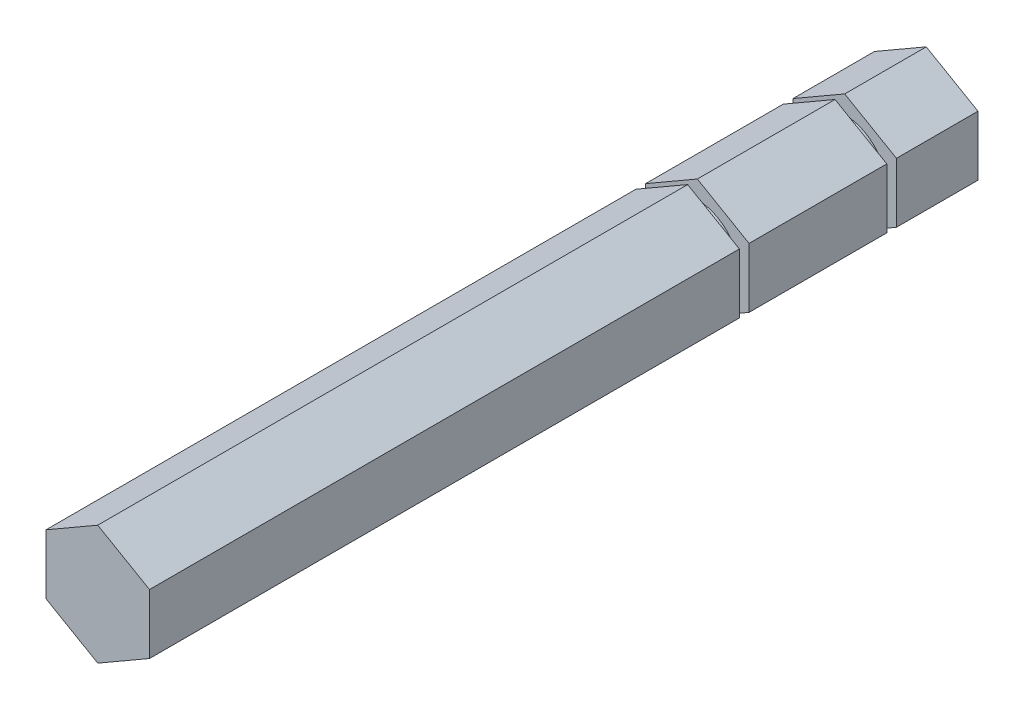
ISO-10303-21;
HEADER;
FILE_DESCRIPTION(('STEP AP214'),'2;1');
FILE_NAME('part.step','',(''),(''),'','','');
FILE_SCHEMA(('AUTOMOTIVE_DESIGN { 1 0 10303 214 1 1 1 1 }'));
ENDSEC;
DATA;
#1=APPLICATION_CONTEXT('core data for automotive mechanical design processes');
#2=APPLICATION_PROTOCOL_DEFINITION('international standard','automotive_design',2000,#1);
#3=PRODUCT_CONTEXT('',#1,'mechanical');
#4=PRODUCT('Part','Part','',(#3));
#5=PRODUCT_RELATED_PRODUCT_CATEGORY('part','',(#4));
#6=PRODUCT_DEFINITION_FORMATION('','',#4);
#7=PRODUCT_DEFINITION_CONTEXT('part definition',#1,'design');
#8=PRODUCT_DEFINITION('design','',#6,#7);
#9=PRODUCT_DEFINITION_SHAPE('','',#8);
#10=(LENGTH_UNIT() NAMED_UNIT(*) SI_UNIT(.MILLI.,.METRE.));
#11=(NAMED_UNIT(*) PLANE_ANGLE_UNIT() SI_UNIT($,.RADIAN.));
#12=(NAMED_UNIT(*) SI_UNIT($,.STERADIAN.) SOLID_ANGLE_UNIT());
#13=UNCERTAINTY_MEASURE_WITH_UNIT(LENGTH_MEASURE(1.E-05),#10,'distance_accuracy_value','');
#14=(GEOMETRIC_REPRESENTATION_CONTEXT(3) GLOBAL_UNCERTAINTY_ASSIGNED_CONTEXT((#13)) GLOBAL_UNIT_ASSIGNED_CONTEXT((#10,
#11,#12)) REPRESENTATION_CONTEXT('',''));
#15=CARTESIAN_POINT('',(0.,0.,0.));
#16=DIRECTION('',(0.,0.,1.));
#17=DIRECTION('',(1.,0.,0.));
#18=AXIS2_PLACEMENT_3D('',#15,#16,#17);
#19=CARTESIAN_POINT('',(4.76249999999996,2.74963065701564,76.2508));
#20=DIRECTION('',(-0.499999999999995,-0.866025403784442,0.));
#21=DIRECTION('',(0.866025403784441,-0.499999999999995,0.));
#22=AXIS2_PLACEMENT_3D('',#19,#20,#21);
#23=PLANE('',#22);
#24=DIRECTION('',(0.,0.,-1.));
#25=VECTOR('',#24,1.);
#26=CARTESIAN_POINT('',(4.76249999999996,2.74963065701564,76.2508));
#27=LINE('',#26,#25);
#28=CARTESIAN_POINT('',(4.76249999999996,2.74963065701564,76.2508));
#29=VERTEX_POINT('',#28);
#30=CARTESIAN_POINT('',(4.76249999999996,2.74963065701564,21.9583));
#31=VERTEX_POINT('',#30);
#32=EDGE_CURVE('E200',#29,#31,#27,.T.);
#33=ORIENTED_EDGE('',*,*,#32,.T.);
#34=DIRECTION('',(-0.866025403784441,0.499999999999995,0.));
#35=VECTOR('',#34,1.);
#36=CARTESIAN_POINT('',(4.76249999999996,2.74963065701564,21.9583));
#37=LINE('',#36,#35);
#38=CARTESIAN_POINT('',(0.,5.49926131403118,21.9583));
#39=VERTEX_POINT('',#38);
#40=EDGE_CURVE('E208',#31,#39,#37,.T.);
#41=ORIENTED_EDGE('',*,*,#40,.T.);
#42=DIRECTION('',(0.,0.,-1.));
#43=VECTOR('',#42,1.);
#44=CARTESIAN_POINT('',(0.,5.49926131403118,76.2508));
#45=LINE('',#44,#43);
#46=CARTESIAN_POINT('',(0.,5.49926131403118,76.2508));
#47=VERTEX_POINT('',#46);
#48=EDGE_CURVE('E178',#47,#39,#45,.T.);
#49=ORIENTED_EDGE('',*,*,#48,.F.);
#50=DIRECTION('',(-0.866025403784441,0.499999999999995,0.));
#51=VECTOR('',#50,1.);
#52=CARTESIAN_POINT('',(4.76249999999996,2.74963065701564,76.2508));
#53=LINE('',#52,#51);
#54=EDGE_CURVE('E210',#29,#47,#53,.T.);
#55=ORIENTED_EDGE('',*,*,#54,.F.);
#56=EDGE_LOOP('',(#33,#41,#49,#55));
#57=FACE_BOUND('',#56,.T.);
#58=ADVANCED_FACE('F33',(#57),#23,.F.);
#59=CARTESIAN_POINT('',(0.,5.49926131403118,76.2508));
#60=DIRECTION('',(0.500000000000001,-0.866025403784438,0.));
#61=DIRECTION('',(0.866025403784438,0.500000000000001,0.));
#62=AXIS2_PLACEMENT_3D('',#59,#60,#61);
#63=PLANE('',#62);
#64=ORIENTED_EDGE('',*,*,#48,.T.);
#65=DIRECTION('',(-0.866025403784438,-0.500000000000001,0.));
#66=VECTOR('',#65,1.);
#67=CARTESIAN_POINT('',(0.,5.49926131403118,21.9583));
#68=LINE('',#67,#66);
#69=CARTESIAN_POINT('',(-4.7625,2.74963065701558,21.9583));
#70=VERTEX_POINT('',#69);
#71=EDGE_CURVE('E330',#39,#70,#68,.T.);
#72=ORIENTED_EDGE('',*,*,#71,.T.);
#73=DIRECTION('',(0.,0.,-1.));
#74=VECTOR('',#73,1.);
#75=CARTESIAN_POINT('',(-4.7625,2.74963065701558,76.2508));
#76=LINE('',#75,#74);
#77=CARTESIAN_POINT('',(-4.7625,2.74963065701558,76.2508));
#78=VERTEX_POINT('',#77);
#79=EDGE_CURVE('E176',#78,#70,#76,.T.);
#80=ORIENTED_EDGE('',*,*,#79,.F.);
#81=DIRECTION('',(-0.866025403784438,-0.500000000000001,0.));
#82=VECTOR('',#81,1.);
#83=CARTESIAN_POINT('',(0.,5.49926131403118,76.2508));
#84=LINE('',#83,#82);
#85=EDGE_CURVE('E242',#47,#78,#84,.T.);
#86=ORIENTED_EDGE('',*,*,#85,.F.);
#87=EDGE_LOOP('',(#64,#72,#80,#86));
#88=FACE_BOUND('',#87,.T.);
#89=ADVANCED_FACE('F332',(#88),#63,.F.);
#90=CARTESIAN_POINT('',(-4.7625,2.74963065701558,76.2508));
#91=DIRECTION('',(1.,0.,0.));
#92=DIRECTION('',(0.,1.,0.));
#93=AXIS2_PLACEMENT_3D('',#90,#91,#92);
#94=PLANE('',#93);
#95=ORIENTED_EDGE('',*,*,#79,.T.);
#96=DIRECTION('',(0.,-1.,0.));
#97=VECTOR('',#96,1.);
#98=CARTESIAN_POINT('',(-4.7625,2.74963065701558,21.9583));
#99=LINE('',#98,#97);
#100=CARTESIAN_POINT('',(-4.76249999999998,-2.74963065701561,21.9583));
#101=VERTEX_POINT('',#100);
#102=EDGE_CURVE('E328',#70,#101,#99,.T.);
#103=ORIENTED_EDGE('',*,*,#102,.T.);
#104=DIRECTION('',(0.,0.,-1.));
#105=VECTOR('',#104,1.);
#106=CARTESIAN_POINT('',(-4.76249999999998,-2.74963065701561,76.2508));
#107=LINE('',#106,#105);
#108=CARTESIAN_POINT('',(-4.76249999999998,-2.74963065701561,76.2508));
#109=VERTEX_POINT('',#108);
#110=EDGE_CURVE('E271',#109,#101,#107,.T.);
#111=ORIENTED_EDGE('',*,*,#110,.F.);
#112=DIRECTION('',(0.,-1.,0.));
#113=VECTOR('',#112,1.);
#114=CARTESIAN_POINT('',(-4.7625,2.74963065701558,76.2508));
#115=LINE('',#114,#113);
#116=EDGE_CURVE('E244',#78,#109,#115,.T.);
#117=ORIENTED_EDGE('',*,*,#116,.F.);
#118=EDGE_LOOP('',(#95,#103,#111,#117));
#119=FACE_BOUND('',#118,.T.);
#120=ADVANCED_FACE('F334',(#119),#94,.F.);
#121=CARTESIAN_POINT('',(-4.76249999999998,-2.74963065701561,76.2508));
#122=DIRECTION('',(0.499999999999995,0.866025403784441,0.));
#123=DIRECTION('',(-0.866025403784442,0.499999999999995,0.));
#124=AXIS2_PLACEMENT_3D('',#121,#122,#123);
#125=PLANE('',#124);
#126=ORIENTED_EDGE('',*,*,#110,.T.);
#127=DIRECTION('',(0.866025403784442,-0.499999999999995,0.));
#128=VECTOR('',#127,1.);
#129=CARTESIAN_POINT('',(-4.76249999999998,-2.74963065701561,21.9583));
#130=LINE('',#129,#128);
#131=CARTESIAN_POINT('',(0.,-5.49926131403118,21.9583));
#132=VERTEX_POINT('',#131);
#133=EDGE_CURVE('E261',#101,#132,#130,.T.);
#134=ORIENTED_EDGE('',*,*,#133,.T.);
#135=DIRECTION('',(0.,0.,-1.));
#136=VECTOR('',#135,1.);
#137=CARTESIAN_POINT('',(0.,-5.49926131403118,76.2508));
#138=LINE('',#137,#136);
#139=CARTESIAN_POINT('',(0.,-5.49926131403118,76.2508));
#140=VERTEX_POINT('',#139);
#141=EDGE_CURVE('E259',#140,#132,#138,.T.);
#142=ORIENTED_EDGE('',*,*,#141,.F.);
#143=DIRECTION('',(0.866025403784442,-0.499999999999995,0.));
#144=VECTOR('',#143,1.);
#145=CARTESIAN_POINT('',(-4.76249999999998,-2.74963065701561,76.2508));
#146=LINE('',#145,#144);
#147=EDGE_CURVE('E224',#109,#140,#146,.T.);
#148=ORIENTED_EDGE('',*,*,#147,.F.);
#149=EDGE_LOOP('',(#126,#134,#142,#148));
#150=FACE_BOUND('',#149,.T.);
#151=ADVANCED_FACE('F260',(#150),#125,.F.);
#152=CARTESIAN_POINT('',(0.,-5.49926131403118,76.2508));
#153=DIRECTION('',(-0.500000000000007,0.866025403784434,0.));
#154=DIRECTION('',(-0.866025403784435,-0.500000000000007,0.));
#155=AXIS2_PLACEMENT_3D('',#152,#153,#154);
#156=PLANE('',#155);
#157=ORIENTED_EDGE('',*,*,#141,.T.);
#158=DIRECTION('',(0.866025403784435,0.500000000000007,0.));
#159=VECTOR('',#158,1.);
#160=CARTESIAN_POINT('',(0.,-5.49926131403118,21.9583));
#161=LINE('',#160,#159);
#162=CARTESIAN_POINT('',(4.76250000000002,-2.74963065701554,21.9583));
#163=VERTEX_POINT('',#162);
#164=EDGE_CURVE('E268',#132,#163,#161,.T.);
#165=ORIENTED_EDGE('',*,*,#164,.T.);
#166=DIRECTION('',(0.,0.,-1.));
#167=VECTOR('',#166,1.);
#168=CARTESIAN_POINT('',(4.76250000000002,-2.74963065701554,76.2508));
#169=LINE('',#168,#167);
#170=CARTESIAN_POINT('',(4.76250000000002,-2.74963065701554,76.2508));
#171=VERTEX_POINT('',#170);
#172=EDGE_CURVE('E203',#171,#163,#169,.T.);
#173=ORIENTED_EDGE('',*,*,#172,.F.);
#174=DIRECTION('',(0.866025403784435,0.500000000000007,0.));
#175=VECTOR('',#174,1.);
#176=CARTESIAN_POINT('',(0.,-5.49926131403118,76.2508));
#177=LINE('',#176,#175);
#178=EDGE_CURVE('E221',#140,#171,#177,.T.);
#179=ORIENTED_EDGE('',*,*,#178,.F.);
#180=EDGE_LOOP('',(#157,#165,#173,#179));
#181=FACE_BOUND('',#180,.T.);
#182=ADVANCED_FACE('F267',(#181),#156,.F.);
#183=CARTESIAN_POINT('',(4.76250000000002,-2.74963065701554,76.2508));
#184=DIRECTION('',(-1.,0.,0.));
#185=DIRECTION('',(0.,-1.,0.));
#186=AXIS2_PLACEMENT_3D('',#183,#184,#185);
#187=PLANE('',#186);
#188=ORIENTED_EDGE('',*,*,#172,.T.);
#189=DIRECTION('',(0.,1.,0.));
#190=VECTOR('',#189,1.);
#191=CARTESIAN_POINT('',(4.76250000000002,-2.74963065701554,21.9583));
#192=LINE('',#191,#190);
#193=EDGE_CURVE('E160',#163,#31,#192,.T.);
#194=ORIENTED_EDGE('',*,*,#193,.T.);
#195=ORIENTED_EDGE('',*,*,#32,.F.);
#196=DIRECTION('',(0.,1.,0.));
#197=VECTOR('',#196,1.);
#198=CARTESIAN_POINT('',(4.76250000000002,-2.74963065701554,76.2508));
#199=LINE('',#198,#197);
#200=EDGE_CURVE('E219',#171,#29,#199,.T.);
#201=ORIENTED_EDGE('',*,*,#200,.F.);
#202=EDGE_LOOP('',(#188,#194,#195,#201));
#203=FACE_BOUND('',#202,.T.);
#204=ADVANCED_FACE('F198',(#203),#187,.F.);
#205=CARTESIAN_POINT('',(0.,0.,76.2508));
#206=DIRECTION('',(0.,0.,1.));
#207=DIRECTION('',(1.,0.,0.));
#208=AXIS2_PLACEMENT_3D('',#205,#206,#207);
#209=PLANE('',#208);
#210=ORIENTED_EDGE('',*,*,#54,.T.);
#211=ORIENTED_EDGE('',*,*,#85,.T.);
#212=ORIENTED_EDGE('',*,*,#116,.T.);
#213=ORIENTED_EDGE('',*,*,#147,.T.);
#214=ORIENTED_EDGE('',*,*,#178,.T.);
#215=ORIENTED_EDGE('',*,*,#200,.T.);
#216=EDGE_LOOP('',(#210,#211,#212,#213,#214,#215));
#217=FACE_BOUND('',#216,.T.);
#218=ADVANCED_FACE('F251',(#217),#209,.T.);
#219=CARTESIAN_POINT('',(0.,0.,21.9583));
#220=DIRECTION('',(0.,0.,1.));
#221=DIRECTION('',(1.,0.,0.));
#222=AXIS2_PLACEMENT_3D('',#219,#220,#221);
#223=PLANE('',#222);
#224=CARTESIAN_POINT('',(0.,0.,21.9583));
#225=DIRECTION('',(0.,0.,-1.));
#226=DIRECTION('',(-1.,0.,0.));
#227=AXIS2_PLACEMENT_3D('',#224,#225,#226);
#228=CIRCLE('',#227,3.8481);
#229=CARTESIAN_POINT('',(-3.8481,0.,21.9583));
#230=VERTEX_POINT('',#229);
#231=EDGE_CURVE('E311',#230,#230,#228,.T.);
#232=ORIENTED_EDGE('',*,*,#231,.F.);
#233=EDGE_LOOP('',(#232));
#234=FACE_BOUND('',#233,.T.);
#235=ORIENTED_EDGE('',*,*,#193,.F.);
#236=ORIENTED_EDGE('',*,*,#164,.F.);
#237=ORIENTED_EDGE('',*,*,#133,.F.);
#238=ORIENTED_EDGE('',*,*,#102,.F.);
#239=ORIENTED_EDGE('',*,*,#71,.F.);
#240=ORIENTED_EDGE('',*,*,#40,.F.);
#241=EDGE_LOOP('',(#235,#236,#237,#238,#239,#240));
#242=FACE_BOUND('',#241,.T.);
#243=ADVANCED_FACE('F335',(#234,#242),#223,.F.);
#244=CARTESIAN_POINT('',(0.,0.,21.0693));
#245=DIRECTION('',(0.,0.,1.));
#246=DIRECTION('',(1.,0.,0.));
#247=AXIS2_PLACEMENT_3D('',#244,#245,#246);
#248=PLANE('',#247);
#249=CARTESIAN_POINT('',(0.,0.,21.0693));
#250=DIRECTION('',(0.,0.,-1.));
#251=DIRECTION('',(-1.,0.,0.));
#252=AXIS2_PLACEMENT_3D('',#249,#250,#251);
#253=CIRCLE('',#252,3.8481);
#254=CARTESIAN_POINT('',(-3.8481,0.,21.0693));
#255=VERTEX_POINT('',#254);
#256=EDGE_CURVE('E310',#255,#255,#253,.T.);
#257=ORIENTED_EDGE('',*,*,#256,.T.);
#258=EDGE_LOOP('',(#257));
#259=FACE_BOUND('',#258,.T.);
#260=DIRECTION('',(-0.866025403784441,0.499999999999995,0.));
#261=VECTOR('',#260,1.);
#262=CARTESIAN_POINT('',(4.76249999999996,2.74963065701564,21.0693));
#263=LINE('',#262,#261);
#264=CARTESIAN_POINT('',(4.76249999999996,2.74963065701564,21.0693));
#265=VERTEX_POINT('',#264);
#266=CARTESIAN_POINT('',(0.,5.49926131403118,21.0693));
#267=VERTEX_POINT('',#266);
#268=EDGE_CURVE('E324',#265,#267,#263,.T.);
#269=ORIENTED_EDGE('',*,*,#268,.T.);
#270=DIRECTION('',(-0.866025403784438,-0.500000000000001,0.));
#271=VECTOR('',#270,1.);
#272=CARTESIAN_POINT('',(0.,5.49926131403118,21.0693));
#273=LINE('',#272,#271);
#274=CARTESIAN_POINT('',(-4.7625,2.74963065701558,21.0693));
#275=VERTEX_POINT('',#274);
#276=EDGE_CURVE('E322',#267,#275,#273,.T.);
#277=ORIENTED_EDGE('',*,*,#276,.T.);
#278=DIRECTION('',(0.,-1.,0.));
#279=VECTOR('',#278,1.);
#280=CARTESIAN_POINT('',(-4.7625,2.74963065701558,21.0693));
#281=LINE('',#280,#279);
#282=CARTESIAN_POINT('',(-4.76249999999998,-2.74963065701561,21.0693));
#283=VERTEX_POINT('',#282);
#284=EDGE_CURVE('E320',#275,#283,#281,.T.);
#285=ORIENTED_EDGE('',*,*,#284,.T.);
#286=DIRECTION('',(0.866025403784442,-0.499999999999995,0.));
#287=VECTOR('',#286,1.);
#288=CARTESIAN_POINT('',(-4.76249999999998,-2.74963065701561,21.0693));
#289=LINE('',#288,#287);
#290=CARTESIAN_POINT('',(0.,-5.49926131403118,21.0693));
#291=VERTEX_POINT('',#290);
#292=EDGE_CURVE('E318',#283,#291,#289,.T.);
#293=ORIENTED_EDGE('',*,*,#292,.T.);
#294=DIRECTION('',(0.866025403784435,0.500000000000007,0.));
#295=VECTOR('',#294,1.);
#296=CARTESIAN_POINT('',(0.,-5.49926131403118,21.0693));
#297=LINE('',#296,#295);
#298=CARTESIAN_POINT('',(4.76250000000002,-2.74963065701554,21.0693));
#299=VERTEX_POINT('',#298);
#300=EDGE_CURVE('E314',#291,#299,#297,.T.);
#301=ORIENTED_EDGE('',*,*,#300,.T.);
#302=DIRECTION('',(0.,1.,0.));
#303=VECTOR('',#302,1.);
#304=CARTESIAN_POINT('',(4.76250000000002,-2.74963065701554,21.0693));
#305=LINE('',#304,#303);
#306=EDGE_CURVE('E185',#299,#265,#305,.T.);
#307=ORIENTED_EDGE('',*,*,#306,.T.);
#308=EDGE_LOOP('',(#269,#277,#285,#293,#301,#307));
#309=FACE_BOUND('',#308,.T.);
#310=ADVANCED_FACE('F337',(#259,#309),#248,.T.);
#311=CARTESIAN_POINT('',(0.,0.,21.9583));
#312=DIRECTION('',(0.,0.,-1.));
#313=DIRECTION('',(-1.,0.,0.));
#314=AXIS2_PLACEMENT_3D('',#311,#312,#313);
#315=CYLINDRICAL_SURFACE('',#314,3.8481);
#316=ORIENTED_EDGE('',*,*,#231,.T.);
#317=EDGE_LOOP('',(#316));
#318=FACE_BOUND('',#317,.T.);
#319=ORIENTED_EDGE('',*,*,#256,.F.);
#320=EDGE_LOOP('',(#319));
#321=FACE_BOUND('',#320,.T.);
#322=ADVANCED_FACE('F344',(#318,#321),#315,.T.);
#323=CARTESIAN_POINT('',(4.76250000000002,-2.74963065701554,8.39470000000001));
#324=VERTEX_POINT('',#323);
#325=EDGE_CURVE('E215',#299,#324,#169,.T.);
#326=ORIENTED_EDGE('',*,*,#325,.T.);
#327=DIRECTION('',(0.,1.,0.));
#328=VECTOR('',#327,1.);
#329=CARTESIAN_POINT('',(4.76250000000002,-2.74963065701554,8.39470000000001));
#330=LINE('',#329,#328);
#331=CARTESIAN_POINT('',(4.76249999999996,2.74963065701564,8.39470000000001));
#332=VERTEX_POINT('',#331);
#333=EDGE_CURVE('E307',#324,#332,#330,.T.);
#334=ORIENTED_EDGE('',*,*,#333,.T.);
#335=EDGE_CURVE('E212',#265,#332,#27,.T.);
#336=ORIENTED_EDGE('',*,*,#335,.F.);
#337=ORIENTED_EDGE('',*,*,#306,.F.);
#338=EDGE_LOOP('',(#326,#334,#336,#337));
#339=FACE_BOUND('',#338,.T.);
#340=ADVANCED_FACE('F371',(#339),#187,.F.);
#341=CARTESIAN_POINT('',(0.,-5.49926131403118,8.39470000000001));
#342=VERTEX_POINT('',#341);
#343=EDGE_CURVE('E264',#291,#342,#138,.T.);
#344=ORIENTED_EDGE('',*,*,#343,.T.);
#345=DIRECTION('',(0.866025403784435,0.500000000000007,0.));
#346=VECTOR('',#345,1.);
#347=CARTESIAN_POINT('',(0.,-5.49926131403118,8.39470000000001));
#348=LINE('',#347,#346);
#349=EDGE_CURVE('E304',#342,#324,#348,.T.);
#350=ORIENTED_EDGE('',*,*,#349,.T.);
#351=ORIENTED_EDGE('',*,*,#325,.F.);
#352=ORIENTED_EDGE('',*,*,#300,.F.);
#353=EDGE_LOOP('',(#344,#350,#351,#352));
#354=FACE_BOUND('',#353,.T.);
#355=ADVANCED_FACE('F375',(#354),#156,.F.);
#356=CARTESIAN_POINT('',(-4.76249999999998,-2.74963065701561,8.39470000000001));
#357=VERTEX_POINT('',#356);
#358=EDGE_CURVE('E272',#283,#357,#107,.T.);
#359=ORIENTED_EDGE('',*,*,#358,.T.);
#360=DIRECTION('',(0.866025403784442,-0.499999999999995,0.));
#361=VECTOR('',#360,1.);
#362=CARTESIAN_POINT('',(-4.76249999999998,-2.74963065701561,8.39470000000001));
#363=LINE('',#362,#361);
#364=EDGE_CURVE('E301',#357,#342,#363,.T.);
#365=ORIENTED_EDGE('',*,*,#364,.T.);
#366=ORIENTED_EDGE('',*,*,#343,.F.);
#367=ORIENTED_EDGE('',*,*,#292,.F.);
#368=EDGE_LOOP('',(#359,#365,#366,#367));
#369=FACE_BOUND('',#368,.T.);
#370=ADVANCED_FACE('F380',(#369),#125,.F.);
#371=CARTESIAN_POINT('',(-4.7625,2.74963065701558,8.39470000000001));
#372=VERTEX_POINT('',#371);
#373=EDGE_CURVE('E181',#275,#372,#76,.T.);
#374=ORIENTED_EDGE('',*,*,#373,.T.);
#375=DIRECTION('',(0.,-1.,0.));
#376=VECTOR('',#375,1.);
#377=CARTESIAN_POINT('',(-4.7625,2.74963065701558,8.39470000000001));
#378=LINE('',#377,#376);
#379=EDGE_CURVE('E298',#372,#357,#378,.T.);
#380=ORIENTED_EDGE('',*,*,#379,.T.);
#381=ORIENTED_EDGE('',*,*,#358,.F.);
#382=ORIENTED_EDGE('',*,*,#284,.F.);
#383=EDGE_LOOP('',(#374,#380,#381,#382));
#384=FACE_BOUND('',#383,.T.);
#385=ADVANCED_FACE('F366',(#384),#94,.F.);
#386=CARTESIAN_POINT('',(0.,5.49926131403118,8.39470000000001));
#387=VERTEX_POINT('',#386);
#388=EDGE_CURVE('E175',#267,#387,#45,.T.);
#389=ORIENTED_EDGE('',*,*,#388,.T.);
#390=DIRECTION('',(-0.866025403784438,-0.500000000000001,0.));
#391=VECTOR('',#390,1.);
#392=CARTESIAN_POINT('',(0.,5.49926131403118,8.39470000000001));
#393=LINE('',#392,#391);
#394=EDGE_CURVE('E47',#387,#372,#393,.T.);
#395=ORIENTED_EDGE('',*,*,#394,.T.);
#396=ORIENTED_EDGE('',*,*,#373,.F.);
#397=ORIENTED_EDGE('',*,*,#276,.F.);
#398=EDGE_LOOP('',(#389,#395,#396,#397));
#399=FACE_BOUND('',#398,.T.);
#400=ADVANCED_FACE('F355',(#399),#63,.F.);
#401=ORIENTED_EDGE('',*,*,#335,.T.);
#402=DIRECTION('',(-0.866025403784441,0.499999999999995,0.));
#403=VECTOR('',#402,1.);
#404=CARTESIAN_POINT('',(4.76249999999996,2.74963065701564,8.39470000000001));
#405=LINE('',#404,#403);
#406=EDGE_CURVE('E11',#332,#387,#405,.T.);
#407=ORIENTED_EDGE('',*,*,#406,.T.);
#408=ORIENTED_EDGE('',*,*,#388,.F.);
#409=ORIENTED_EDGE('',*,*,#268,.F.);
#410=EDGE_LOOP('',(#401,#407,#408,#409));
#411=FACE_BOUND('',#410,.T.);
#412=ADVANCED_FACE('F351',(#411),#23,.F.);
#413=CARTESIAN_POINT('',(0.,0.,8.3947));
#414=DIRECTION('',(0.,0.,1.));
#415=DIRECTION('',(1.,0.,0.));
#416=AXIS2_PLACEMENT_3D('',#413,#414,#415);
#417=PLANE('',#416);
#418=CARTESIAN_POINT('',(0.,0.,8.3947));
#419=DIRECTION('',(0.,0.,-1.));
#420=DIRECTION('',(-1.,0.,0.));
#421=AXIS2_PLACEMENT_3D('',#418,#419,#420);
#422=CIRCLE('',#421,3.8481);
#423=CARTESIAN_POINT('',(-3.8481,0.,8.3947));
#424=VERTEX_POINT('',#423);
#425=EDGE_CURVE('E169',#424,#424,#422,.T.);
#426=ORIENTED_EDGE('',*,*,#425,.F.);
#427=EDGE_LOOP('',(#426));
#428=FACE_BOUND('',#427,.T.);
#429=ORIENTED_EDGE('',*,*,#349,.F.);
#430=ORIENTED_EDGE('',*,*,#364,.F.);
#431=ORIENTED_EDGE('',*,*,#379,.F.);
#432=ORIENTED_EDGE('',*,*,#394,.F.);
#433=ORIENTED_EDGE('',*,*,#406,.F.);
#434=ORIENTED_EDGE('',*,*,#333,.F.);
#435=EDGE_LOOP('',(#429,#430,#431,#432,#433,#434));
#436=FACE_BOUND('',#435,.T.);
#437=ADVANCED_FACE('F358',(#428,#436),#417,.F.);
#438=CARTESIAN_POINT('',(0.,0.,7.5057));
#439=DIRECTION('',(0.,0.,1.));
#440=DIRECTION('',(1.,0.,0.));
#441=AXIS2_PLACEMENT_3D('',#438,#439,#440);
#442=PLANE('',#441);
#443=CARTESIAN_POINT('',(0.,0.,7.5057));
#444=DIRECTION('',(0.,0.,-1.));
#445=DIRECTION('',(-1.,0.,0.));
#446=AXIS2_PLACEMENT_3D('',#443,#444,#445);
#447=CIRCLE('',#446,3.8481);
#448=CARTESIAN_POINT('',(-3.8481,0.,7.5057));
#449=VERTEX_POINT('',#448);
#450=EDGE_CURVE('E570',#449,#449,#447,.T.);
#451=ORIENTED_EDGE('',*,*,#450,.T.);
#452=EDGE_LOOP('',(#451));
#453=FACE_BOUND('',#452,.T.);
#454=DIRECTION('',(0.,1.,0.));
#455=VECTOR('',#454,1.);
#456=CARTESIAN_POINT('',(4.76250000000002,-2.74963065701554,7.5057));
#457=LINE('',#456,#455);
#458=CARTESIAN_POINT('',(4.76250000000002,-2.74963065701554,7.5057));
#459=VERTEX_POINT('',#458);
#460=CARTESIAN_POINT('',(4.76249999999996,2.74963065701564,7.5057));
#461=VERTEX_POINT('',#460);
#462=EDGE_CURVE('E54',#459,#461,#457,.T.);
#463=ORIENTED_EDGE('',*,*,#462,.T.);
#464=DIRECTION('',(-0.866025403784441,0.499999999999995,0.));
#465=VECTOR('',#464,1.);
#466=CARTESIAN_POINT('',(4.76249999999996,2.74963065701564,7.5057));
#467=LINE('',#466,#465);
#468=CARTESIAN_POINT('',(0.,5.49926131403118,7.5057));
#469=VERTEX_POINT('',#468);
#470=EDGE_CURVE('E40',#461,#469,#467,.T.);
#471=ORIENTED_EDGE('',*,*,#470,.T.);
#472=DIRECTION('',(-0.866025403784438,-0.500000000000001,0.));
#473=VECTOR('',#472,1.);
#474=CARTESIAN_POINT('',(0.,5.49926131403118,7.5057));
#475=LINE('',#474,#473);
#476=CARTESIAN_POINT('',(-4.7625,2.74963065701558,7.5057));
#477=VERTEX_POINT('',#476);
#478=EDGE_CURVE('E155',#469,#477,#475,.T.);
#479=ORIENTED_EDGE('',*,*,#478,.T.);
#480=DIRECTION('',(0.,-1.,0.));
#481=VECTOR('',#480,1.);
#482=CARTESIAN_POINT('',(-4.7625,2.74963065701558,7.5057));
#483=LINE('',#482,#481);
#484=CARTESIAN_POINT('',(-4.76249999999998,-2.74963065701561,7.5057));
#485=VERTEX_POINT('',#484);
#486=EDGE_CURVE('E168',#477,#485,#483,.T.);
#487=ORIENTED_EDGE('',*,*,#486,.T.);
#488=DIRECTION('',(0.866025403784442,-0.499999999999995,0.));
#489=VECTOR('',#488,1.);
#490=CARTESIAN_POINT('',(-4.76249999999998,-2.74963065701561,7.5057));
#491=LINE('',#490,#489);
#492=CARTESIAN_POINT('',(0.,-5.49926131403118,7.5057));
#493=VERTEX_POINT('',#492);
#494=EDGE_CURVE('E281',#485,#493,#491,.T.);
#495=ORIENTED_EDGE('',*,*,#494,.T.);
#496=DIRECTION('',(0.866025403784435,0.500000000000007,0.));
#497=VECTOR('',#496,1.);
#498=CARTESIAN_POINT('',(0.,-5.49926131403118,7.5057));
#499=LINE('',#498,#497);
#500=EDGE_CURVE('E291',#493,#459,#499,.T.);
#501=ORIENTED_EDGE('',*,*,#500,.T.);
#502=EDGE_LOOP('',(#463,#471,#479,#487,#495,#501));
#503=FACE_BOUND('',#502,.T.);
#504=ADVANCED_FACE('F154',(#453,#503),#442,.T.);
#505=CARTESIAN_POINT('',(0.,0.,8.3947));
#506=DIRECTION('',(0.,0.,-1.));
#507=DIRECTION('',(-1.,0.,0.));
#508=AXIS2_PLACEMENT_3D('',#505,#506,#507);
#509=CYLINDRICAL_SURFACE('',#508,3.8481);
#510=ORIENTED_EDGE('',*,*,#425,.T.);
#511=EDGE_LOOP('',(#510));
#512=FACE_BOUND('',#511,.T.);
#513=ORIENTED_EDGE('',*,*,#450,.F.);
#514=EDGE_LOOP('',(#513));
#515=FACE_BOUND('',#514,.T.);
#516=ADVANCED_FACE('F412',(#512,#515),#509,.T.);
#517=CARTESIAN_POINT('',(0.,0.,0.));
#518=DIRECTION('',(0.,0.,1.));
#519=DIRECTION('',(1.,0.,0.));
#520=AXIS2_PLACEMENT_3D('',#517,#518,#519);
#521=PLANE('',#520);
#522=DIRECTION('',(-0.866025403784441,0.499999999999995,0.));
#523=VECTOR('',#522,1.);
#524=CARTESIAN_POINT('',(4.76249999999996,2.74963065701564,0.));
#525=LINE('',#524,#523);
#526=CARTESIAN_POINT('',(4.76249999999996,2.74963065701564,0.));
#527=VERTEX_POINT('',#526);
#528=CARTESIAN_POINT('',(0.,5.49926131403118,0.));
#529=VERTEX_POINT('',#528);
#530=EDGE_CURVE('E174',#527,#529,#525,.T.);
#531=ORIENTED_EDGE('',*,*,#530,.F.);
#532=DIRECTION('',(0.,1.,0.));
#533=VECTOR('',#532,1.);
#534=CARTESIAN_POINT('',(4.76250000000002,-2.74963065701554,0.));
#535=LINE('',#534,#533);
#536=CARTESIAN_POINT('',(4.76250000000002,-2.74963065701554,0.));
#537=VERTEX_POINT('',#536);
#538=EDGE_CURVE('E239',#537,#527,#535,.T.);
#539=ORIENTED_EDGE('',*,*,#538,.F.);
#540=DIRECTION('',(0.866025403784435,0.500000000000007,0.));
#541=VECTOR('',#540,1.);
#542=CARTESIAN_POINT('',(0.,-5.49926131403118,0.));
#543=LINE('',#542,#541);
#544=CARTESIAN_POINT('',(0.,-5.49926131403118,0.));
#545=VERTEX_POINT('',#544);
#546=EDGE_CURVE('E237',#545,#537,#543,.T.);
#547=ORIENTED_EDGE('',*,*,#546,.F.);
#548=DIRECTION('',(0.866025403784442,-0.499999999999995,0.));
#549=VECTOR('',#548,1.);
#550=CARTESIAN_POINT('',(-4.76249999999998,-2.74963065701561,0.));
#551=LINE('',#550,#549);
#552=CARTESIAN_POINT('',(-4.76249999999998,-2.74963065701561,0.));
#553=VERTEX_POINT('',#552);
#554=EDGE_CURVE('E234',#553,#545,#551,.T.);
#555=ORIENTED_EDGE('',*,*,#554,.F.);
#556=DIRECTION('',(0.,-1.,0.));
#557=VECTOR('',#556,1.);
#558=CARTESIAN_POINT('',(-4.7625,2.74963065701558,0.));
#559=LINE('',#558,#557);
#560=CARTESIAN_POINT('',(-4.7625,2.74963065701558,0.));
#561=VERTEX_POINT('',#560);
#562=EDGE_CURVE('E231',#561,#553,#559,.T.);
#563=ORIENTED_EDGE('',*,*,#562,.F.);
#564=DIRECTION('',(-0.866025403784438,-0.500000000000001,0.));
#565=VECTOR('',#564,1.);
#566=CARTESIAN_POINT('',(0.,5.49926131403118,0.));
#567=LINE('',#566,#565);
#568=EDGE_CURVE('E229',#529,#561,#567,.T.);
#569=ORIENTED_EDGE('',*,*,#568,.F.);
#570=EDGE_LOOP('',(#531,#539,#547,#555,#563,#569));
#571=FACE_BOUND('',#570,.T.);
#572=ADVANCED_FACE('F286',(#571),#521,.F.);
#573=ORIENTED_EDGE('',*,*,#470,.F.);
#574=EDGE_CURVE('E214',#461,#527,#27,.T.);
#575=ORIENTED_EDGE('',*,*,#574,.T.);
#576=ORIENTED_EDGE('',*,*,#530,.T.);
#577=EDGE_CURVE('E165',#469,#529,#45,.T.);
#578=ORIENTED_EDGE('',*,*,#577,.F.);
#579=EDGE_LOOP('',(#573,#575,#576,#578));
#580=FACE_BOUND('',#579,.T.);
#581=ADVANCED_FACE('F172',(#580),#23,.F.);
#582=ORIENTED_EDGE('',*,*,#478,.F.);
#583=ORIENTED_EDGE('',*,*,#577,.T.);
#584=ORIENTED_EDGE('',*,*,#568,.T.);
#585=EDGE_CURVE('E167',#477,#561,#76,.T.);
#586=ORIENTED_EDGE('',*,*,#585,.F.);
#587=EDGE_LOOP('',(#582,#583,#584,#586));
#588=FACE_BOUND('',#587,.T.);
#589=ADVANCED_FACE('F163',(#588),#63,.F.);
#590=ORIENTED_EDGE('',*,*,#486,.F.);
#591=ORIENTED_EDGE('',*,*,#585,.T.);
#592=ORIENTED_EDGE('',*,*,#562,.T.);
#593=EDGE_CURVE('E263',#485,#553,#107,.T.);
#594=ORIENTED_EDGE('',*,*,#593,.F.);
#595=EDGE_LOOP('',(#590,#591,#592,#594));
#596=FACE_BOUND('',#595,.T.);
#597=ADVANCED_FACE('F284',(#596),#94,.F.);
#598=ORIENTED_EDGE('',*,*,#494,.F.);
#599=ORIENTED_EDGE('',*,*,#593,.T.);
#600=ORIENTED_EDGE('',*,*,#554,.T.);
#601=EDGE_CURVE('E266',#493,#545,#138,.T.);
#602=ORIENTED_EDGE('',*,*,#601,.F.);
#603=EDGE_LOOP('',(#598,#599,#600,#602));
#604=FACE_BOUND('',#603,.T.);
#605=ADVANCED_FACE('F277',(#604),#125,.F.);
#606=ORIENTED_EDGE('',*,*,#500,.F.);
#607=ORIENTED_EDGE('',*,*,#601,.T.);
#608=ORIENTED_EDGE('',*,*,#546,.T.);
#609=EDGE_CURVE('E211',#459,#537,#169,.T.);
#610=ORIENTED_EDGE('',*,*,#609,.F.);
#611=EDGE_LOOP('',(#606,#607,#608,#610));
#612=FACE_BOUND('',#611,.T.);
#613=ADVANCED_FACE('F290',(#612),#156,.F.);
#614=ORIENTED_EDGE('',*,*,#462,.F.);
#615=ORIENTED_EDGE('',*,*,#609,.T.);
#616=ORIENTED_EDGE('',*,*,#538,.T.);
#617=ORIENTED_EDGE('',*,*,#574,.F.);
#618=EDGE_LOOP('',(#614,#615,#616,#617));
#619=FACE_BOUND('',#618,.T.);
#620=ADVANCED_FACE('F471',(#619),#187,.F.);
#621=CLOSED_SHELL('',(#58,#89,#120,#151,#182,#204,#218,#243,#310,#322,#340,#355,#370,#385,#400,
#412,#437,#504,#516,#572,#581,#589,#597,#605,#613,#620));
#622=MANIFOLD_SOLID_BREP('B2',#621);
#623=ADVANCED_BREP_SHAPE_REPRESENTATION('',(#18,#622),#14);
#624=SHAPE_DEFINITION_REPRESENTATION(#9,#623);
ENDSEC;
END-ISO-10303-21;
